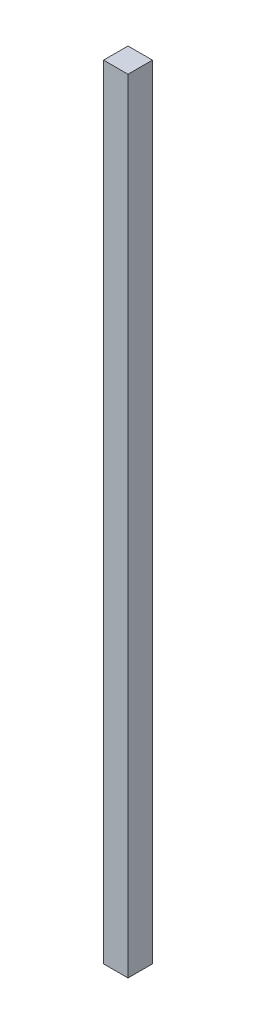
ISO-10303-21;
HEADER;
FILE_DESCRIPTION(('STEP AP214'),'2;1');
FILE_NAME('part.step','',(''),(''),'','','');
FILE_SCHEMA(('AUTOMOTIVE_DESIGN { 1 0 10303 214 1 1 1 1 }'));
ENDSEC;
DATA;
#1=APPLICATION_CONTEXT('core data for automotive mechanical design processes');
#2=APPLICATION_PROTOCOL_DEFINITION('international standard','automotive_design',2000,#1);
#3=PRODUCT_CONTEXT('',#1,'mechanical');
#4=PRODUCT('Part','Part','',(#3));
#5=PRODUCT_RELATED_PRODUCT_CATEGORY('part','',(#4));
#6=PRODUCT_DEFINITION_FORMATION('','',#4);
#7=PRODUCT_DEFINITION_CONTEXT('part definition',#1,'design');
#8=PRODUCT_DEFINITION('design','',#6,#7);
#9=PRODUCT_DEFINITION_SHAPE('','',#8);
#10=(LENGTH_UNIT() NAMED_UNIT(*) SI_UNIT(.MILLI.,.METRE.));
#11=(NAMED_UNIT(*) PLANE_ANGLE_UNIT() SI_UNIT($,.RADIAN.));
#12=(NAMED_UNIT(*) SI_UNIT($,.STERADIAN.) SOLID_ANGLE_UNIT());
#13=UNCERTAINTY_MEASURE_WITH_UNIT(LENGTH_MEASURE(1.E-05),#10,'distance_accuracy_value','');
#14=(GEOMETRIC_REPRESENTATION_CONTEXT(3) GLOBAL_UNCERTAINTY_ASSIGNED_CONTEXT((#13)) GLOBAL_UNIT_ASSIGNED_CONTEXT((#10,
#11,#12)) REPRESENTATION_CONTEXT('',''));
#15=CARTESIAN_POINT('',(0.,0.,0.));
#16=DIRECTION('',(0.,0.,1.));
#17=DIRECTION('',(1.,0.,0.));
#18=AXIS2_PLACEMENT_3D('',#15,#16,#17);
#19=CARTESIAN_POINT('',(19.05,1219.2,-19.05));
#20=DIRECTION('',(-1.,0.,0.));
#21=DIRECTION('',(0.,0.,1.));
#22=AXIS2_PLACEMENT_3D('',#19,#20,#21);
#23=PLANE('',#22);
#24=DIRECTION('',(0.,0.,-1.));
#25=VECTOR('',#24,1.);
#26=CARTESIAN_POINT('',(19.05,0.,-19.05));
#27=LINE('',#26,#25);
#28=CARTESIAN_POINT('',(19.05,0.,19.05));
#29=VERTEX_POINT('',#28);
#30=CARTESIAN_POINT('',(19.05,0.,-19.05));
#31=VERTEX_POINT('',#30);
#32=EDGE_CURVE('E107',#29,#31,#27,.T.);
#33=ORIENTED_EDGE('',*,*,#32,.T.);
#34=DIRECTION('',(0.,-1.,0.));
#35=VECTOR('',#34,1.);
#36=CARTESIAN_POINT('',(19.05,1219.2,-19.05));
#37=LINE('',#36,#35);
#38=CARTESIAN_POINT('',(19.05,1219.2,-19.05));
#39=VERTEX_POINT('',#38);
#40=EDGE_CURVE('E11',#39,#31,#37,.T.);
#41=ORIENTED_EDGE('',*,*,#40,.F.);
#42=DIRECTION('',(0.,0.,-1.));
#43=VECTOR('',#42,1.);
#44=CARTESIAN_POINT('',(19.05,1219.2,-19.05));
#45=LINE('',#44,#43);
#46=CARTESIAN_POINT('',(19.05,1219.2,19.05));
#47=VERTEX_POINT('',#46);
#48=EDGE_CURVE('E91',#47,#39,#45,.T.);
#49=ORIENTED_EDGE('',*,*,#48,.F.);
#50=DIRECTION('',(0.,-1.,0.));
#51=VECTOR('',#50,1.);
#52=CARTESIAN_POINT('',(19.05,1219.2,19.05));
#53=LINE('',#52,#51);
#54=EDGE_CURVE('E103',#47,#29,#53,.T.);
#55=ORIENTED_EDGE('',*,*,#54,.T.);
#56=EDGE_LOOP('',(#33,#41,#49,#55));
#57=FACE_BOUND('',#56,.T.);
#58=ADVANCED_FACE('F39',(#57),#23,.F.);
#59=CARTESIAN_POINT('',(-19.05,1219.2,-19.05));
#60=DIRECTION('',(0.,0.,1.));
#61=DIRECTION('',(1.,0.,0.));
#62=AXIS2_PLACEMENT_3D('',#59,#60,#61);
#63=PLANE('',#62);
#64=DIRECTION('',(-1.,0.,0.));
#65=VECTOR('',#64,1.);
#66=CARTESIAN_POINT('',(-19.05,0.,-19.05));
#67=LINE('',#66,#65);
#68=CARTESIAN_POINT('',(-19.05,0.,-19.05));
#69=VERTEX_POINT('',#68);
#70=EDGE_CURVE('E96',#31,#69,#67,.T.);
#71=ORIENTED_EDGE('',*,*,#70,.T.);
#72=DIRECTION('',(0.,-1.,0.));
#73=VECTOR('',#72,1.);
#74=CARTESIAN_POINT('',(-19.05,1219.2,-19.05));
#75=LINE('',#74,#73);
#76=CARTESIAN_POINT('',(-19.05,1219.2,-19.05));
#77=VERTEX_POINT('',#76);
#78=EDGE_CURVE('E48',#77,#69,#75,.T.);
#79=ORIENTED_EDGE('',*,*,#78,.F.);
#80=DIRECTION('',(-1.,0.,0.));
#81=VECTOR('',#80,1.);
#82=CARTESIAN_POINT('',(-19.05,1219.2,-19.05));
#83=LINE('',#82,#81);
#84=EDGE_CURVE('E86',#39,#77,#83,.T.);
#85=ORIENTED_EDGE('',*,*,#84,.F.);
#86=ORIENTED_EDGE('',*,*,#40,.T.);
#87=EDGE_LOOP('',(#71,#79,#85,#86));
#88=FACE_BOUND('',#87,.T.);
#89=ADVANCED_FACE('F95',(#88),#63,.F.);
#90=CARTESIAN_POINT('',(-19.05,1219.2,-19.05));
#91=DIRECTION('',(1.,0.,0.));
#92=DIRECTION('',(0.,0.,-1.));
#93=AXIS2_PLACEMENT_3D('',#90,#91,#92);
#94=PLANE('',#93);
#95=DIRECTION('',(0.,0.,1.));
#96=VECTOR('',#95,1.);
#97=CARTESIAN_POINT('',(-19.05,0.,-19.05));
#98=LINE('',#97,#96);
#99=CARTESIAN_POINT('',(-19.05,0.,19.05));
#100=VERTEX_POINT('',#99);
#101=EDGE_CURVE('E73',#69,#100,#98,.T.);
#102=ORIENTED_EDGE('',*,*,#101,.T.);
#103=DIRECTION('',(0.,-1.,0.));
#104=VECTOR('',#103,1.);
#105=CARTESIAN_POINT('',(-19.05,1219.2,19.05));
#106=LINE('',#105,#104);
#107=CARTESIAN_POINT('',(-19.05,1219.2,19.05));
#108=VERTEX_POINT('',#107);
#109=EDGE_CURVE('E98',#108,#100,#106,.T.);
#110=ORIENTED_EDGE('',*,*,#109,.F.);
#111=DIRECTION('',(0.,0.,1.));
#112=VECTOR('',#111,1.);
#113=CARTESIAN_POINT('',(-19.05,1219.2,-19.05));
#114=LINE('',#113,#112);
#115=EDGE_CURVE('E89',#77,#108,#114,.T.);
#116=ORIENTED_EDGE('',*,*,#115,.F.);
#117=ORIENTED_EDGE('',*,*,#78,.T.);
#118=EDGE_LOOP('',(#102,#110,#116,#117));
#119=FACE_BOUND('',#118,.T.);
#120=ADVANCED_FACE('F99',(#119),#94,.F.);
#121=CARTESIAN_POINT('',(-19.05,1219.2,19.05));
#122=DIRECTION('',(0.,0.,-1.));
#123=DIRECTION('',(-1.,0.,0.));
#124=AXIS2_PLACEMENT_3D('',#121,#122,#123);
#125=PLANE('',#124);
#126=DIRECTION('',(1.,0.,0.));
#127=VECTOR('',#126,1.);
#128=CARTESIAN_POINT('',(-19.05,0.,19.05));
#129=LINE('',#128,#127);
#130=EDGE_CURVE('E79',#100,#29,#129,.T.);
#131=ORIENTED_EDGE('',*,*,#130,.T.);
#132=ORIENTED_EDGE('',*,*,#54,.F.);
#133=DIRECTION('',(1.,0.,0.));
#134=VECTOR('',#133,1.);
#135=CARTESIAN_POINT('',(-19.05,1219.2,19.05));
#136=LINE('',#135,#134);
#137=EDGE_CURVE('E56',#108,#47,#136,.T.);
#138=ORIENTED_EDGE('',*,*,#137,.F.);
#139=ORIENTED_EDGE('',*,*,#109,.T.);
#140=EDGE_LOOP('',(#131,#132,#138,#139));
#141=FACE_BOUND('',#140,.T.);
#142=ADVANCED_FACE('F120',(#141),#125,.F.);
#143=CARTESIAN_POINT('',(0.,1219.2,0.));
#144=DIRECTION('',(0.,1.,0.));
#145=DIRECTION('',(0.,0.,1.));
#146=AXIS2_PLACEMENT_3D('',#143,#144,#145);
#147=PLANE('',#146);
#148=ORIENTED_EDGE('',*,*,#48,.T.);
#149=ORIENTED_EDGE('',*,*,#84,.T.);
#150=ORIENTED_EDGE('',*,*,#115,.T.);
#151=ORIENTED_EDGE('',*,*,#137,.T.);
#152=EDGE_LOOP('',(#148,#149,#150,#151));
#153=FACE_BOUND('',#152,.T.);
#154=ADVANCED_FACE('F87',(#153),#147,.T.);
#155=CARTESIAN_POINT('',(0.,0.,0.));
#156=DIRECTION('',(0.,1.,0.));
#157=DIRECTION('',(0.,0.,1.));
#158=AXIS2_PLACEMENT_3D('',#155,#156,#157);
#159=PLANE('',#158);
#160=ORIENTED_EDGE('',*,*,#32,.F.);
#161=ORIENTED_EDGE('',*,*,#130,.F.);
#162=ORIENTED_EDGE('',*,*,#101,.F.);
#163=ORIENTED_EDGE('',*,*,#70,.F.);
#164=EDGE_LOOP('',(#160,#161,#162,#163));
#165=FACE_BOUND('',#164,.T.);
#166=ADVANCED_FACE('F123',(#165),#159,.F.);
#167=CLOSED_SHELL('',(#58,#89,#120,#142,#154,#166));
#168=MANIFOLD_SOLID_BREP('B2',#167);
#169=ADVANCED_BREP_SHAPE_REPRESENTATION('',(#18,#168),#14);
#170=SHAPE_DEFINITION_REPRESENTATION(#9,#169);
ENDSEC;
END-ISO-10303-21;
